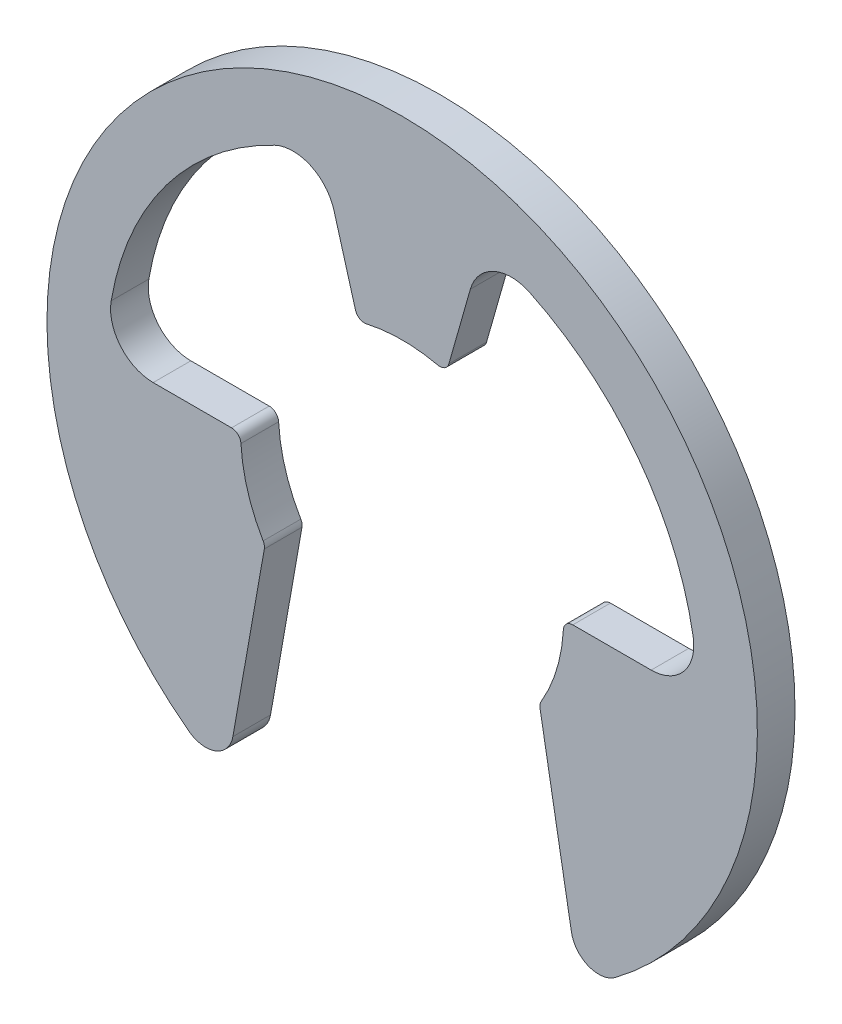
ISO-10303-21;
HEADER;
FILE_DESCRIPTION(('STEP AP214'),'2;1');
FILE_NAME('part.step','',(''),(''),'','','');
FILE_SCHEMA(('AUTOMOTIVE_DESIGN { 1 0 10303 214 1 1 1 1 }'));
ENDSEC;
DATA;
#1=APPLICATION_CONTEXT('core data for automotive mechanical design processes');
#2=APPLICATION_PROTOCOL_DEFINITION('international standard','automotive_design',2000,#1);
#3=PRODUCT_CONTEXT('',#1,'mechanical');
#4=PRODUCT('Part','Part','',(#3));
#5=PRODUCT_RELATED_PRODUCT_CATEGORY('part','',(#4));
#6=PRODUCT_DEFINITION_FORMATION('','',#4);
#7=PRODUCT_DEFINITION_CONTEXT('part definition',#1,'design');
#8=PRODUCT_DEFINITION('design','',#6,#7);
#9=PRODUCT_DEFINITION_SHAPE('','',#8);
#10=(LENGTH_UNIT() NAMED_UNIT(*) SI_UNIT(.MILLI.,.METRE.));
#11=(NAMED_UNIT(*) PLANE_ANGLE_UNIT() SI_UNIT($,.RADIAN.));
#12=(NAMED_UNIT(*) SI_UNIT($,.STERADIAN.) SOLID_ANGLE_UNIT());
#13=UNCERTAINTY_MEASURE_WITH_UNIT(LENGTH_MEASURE(1.E-05),#10,'distance_accuracy_value','');
#14=(GEOMETRIC_REPRESENTATION_CONTEXT(3) GLOBAL_UNCERTAINTY_ASSIGNED_CONTEXT((#13)) GLOBAL_UNIT_ASSIGNED_CONTEXT((#10,
#11,#12)) REPRESENTATION_CONTEXT('',''));
#15=CARTESIAN_POINT('',(0.,0.,0.));
#16=DIRECTION('',(0.,0.,1.));
#17=DIRECTION('',(1.,0.,0.));
#18=AXIS2_PLACEMENT_3D('',#15,#16,#17);
#19=CARTESIAN_POINT('',(-8.382,0.,0.444500000000002));
#20=DIRECTION('',(0.,0.,1.));
#21=DIRECTION('',(1.,0.,0.));
#22=AXIS2_PLACEMENT_3D('',#19,#20,#21);
#23=PLANE('',#22);
#24=CARTESIAN_POINT('',(0.,0.,0.444500000000002));
#25=DIRECTION('',(0.,0.,1.));
#26=DIRECTION('',(-1.,0.,0.));
#27=AXIS2_PLACEMENT_3D('',#24,#25,#26);
#28=CIRCLE('',#27,3.81);
#29=CARTESIAN_POINT('',(3.28050529529567,-1.93762354639312,0.444500000000002));
#30=VERTEX_POINT('',#29);
#31=CARTESIAN_POINT('',(3.80420819619537,-0.21,0.444500000000002));
#32=VERTEX_POINT('',#31);
#33=EDGE_CURVE('E349',#30,#32,#28,.T.);
#34=ORIENTED_EDGE('',*,*,#33,.F.);
#35=CARTESIAN_POINT('',(3.47186810418792,-2.05065158659938,0.4445));
#36=DIRECTION('',(0.,0.,1.));
#37=DIRECTION('',(1.,0.,0.));
#38=AXIS2_PLACEMENT_3D('',#35,#36,#37);
#39=CIRCLE('',#38,0.22225);
#40=CARTESIAN_POINT('',(3.25299458108096,-2.08924489408586,0.444500000000002));
#41=VERTEX_POINT('',#40);
#42=EDGE_CURVE('E293',#30,#41,#39,.T.);
#43=ORIENTED_EDGE('',*,*,#42,.T.);
#44=DIRECTION('',(-0.173648177666931,0.984807753012208,0.));
#45=VECTOR('',#44,1.);
#46=CARTESIAN_POINT('',(3.2385,-2.00704203991845,0.444500000000002));
#47=LINE('',#46,#45);
#48=CARTESIAN_POINT('',(3.99457499603785,-6.29495641921542,0.444500000000002));
#49=VERTEX_POINT('',#48);
#50=EDGE_CURVE('E341',#49,#41,#47,.T.);
#51=ORIENTED_EDGE('',*,*,#50,.F.);
#52=CARTESIAN_POINT('',(4.63843836572622,-6.1814259352495,0.4445));
#53=DIRECTION('',(0.,0.,1.));
#54=DIRECTION('',(1.,0.,0.));
#55=AXIS2_PLACEMENT_3D('',#52,#53,#54);
#56=CIRCLE('',#55,0.653796);
#57=CARTESIAN_POINT('',(5.0308442144536,-6.70436652413177,0.444499999999999));
#58=VERTEX_POINT('',#57);
#59=EDGE_CURVE('E264',#49,#58,#56,.T.);
#60=ORIENTED_EDGE('',*,*,#59,.T.);
#61=CARTESIAN_POINT('',(0.,0.,0.4445));
#62=DIRECTION('',(0.,0.,-1.));
#63=DIRECTION('',(-1.,0.,0.));
#64=AXIS2_PLACEMENT_3D('',#61,#62,#63);
#65=CIRCLE('',#64,8.382);
#66=CARTESIAN_POINT('',(-5.0308442144536,-6.70436652413177,0.444500000000001));
#67=VERTEX_POINT('',#66);
#68=EDGE_CURVE('E228',#67,#58,#65,.T.);
#69=ORIENTED_EDGE('',*,*,#68,.F.);
#70=CARTESIAN_POINT('',(-4.63843836572622,-6.1814259352495,0.444500000000002));
#71=DIRECTION('',(0.,0.,1.));
#72=DIRECTION('',(1.,0.,0.));
#73=AXIS2_PLACEMENT_3D('',#70,#71,#72);
#74=CIRCLE('',#73,0.653796);
#75=CARTESIAN_POINT('',(-3.99457499603785,-6.29495641921542,0.444500000000002));
#76=VERTEX_POINT('',#75);
#77=EDGE_CURVE('E261',#67,#76,#74,.T.);
#78=ORIENTED_EDGE('',*,*,#77,.T.);
#79=DIRECTION('',(-0.173648177666931,-0.984807753012208,0.));
#80=VECTOR('',#79,1.);
#81=CARTESIAN_POINT('',(-3.2385,-2.00704203991845,0.444500000000002));
#82=LINE('',#81,#80);
#83=CARTESIAN_POINT('',(-3.25299458108096,-2.08924489408586,0.444500000000002));
#84=VERTEX_POINT('',#83);
#85=EDGE_CURVE('E338',#84,#76,#82,.T.);
#86=ORIENTED_EDGE('',*,*,#85,.F.);
#87=CARTESIAN_POINT('',(-3.47186810418792,-2.05065158659938,0.444500000000001));
#88=DIRECTION('',(0.,0.,1.));
#89=DIRECTION('',(1.,0.,0.));
#90=AXIS2_PLACEMENT_3D('',#87,#88,#89);
#91=CIRCLE('',#90,0.22225);
#92=CARTESIAN_POINT('',(-3.28050529529567,-1.93762354639312,0.444500000000002));
#93=VERTEX_POINT('',#92);
#94=EDGE_CURVE('E285',#84,#93,#91,.T.);
#95=ORIENTED_EDGE('',*,*,#94,.T.);
#96=CARTESIAN_POINT('',(0.,0.,0.444500000000002));
#97=DIRECTION('',(0.,0.,1.));
#98=DIRECTION('',(1.,0.,0.));
#99=AXIS2_PLACEMENT_3D('',#96,#97,#98);
#100=CIRCLE('',#99,3.81000000000003);
#101=CARTESIAN_POINT('',(-3.80420819619536,-0.21,0.444500000000002));
#102=VERTEX_POINT('',#101);
#103=EDGE_CURVE('E329',#102,#93,#100,.T.);
#104=ORIENTED_EDGE('',*,*,#103,.F.);
#105=CARTESIAN_POINT('',(-4.02612034097343,-0.22225,0.444500000000002));
#106=DIRECTION('',(0.,0.,1.));
#107=DIRECTION('',(1.,0.,0.));
#108=AXIS2_PLACEMENT_3D('',#105,#106,#107);
#109=CIRCLE('',#108,0.22225);
#110=CARTESIAN_POINT('',(-4.02612034097343,0.,0.444500000000002));
#111=VERTEX_POINT('',#110);
#112=EDGE_CURVE('E283',#102,#111,#109,.T.);
#113=ORIENTED_EDGE('',*,*,#112,.T.);
#114=DIRECTION('',(1.,0.,0.));
#115=VECTOR('',#114,1.);
#116=CARTESIAN_POINT('',(-6.96685714285714,0.,0.444500000000002));
#117=LINE('',#116,#115);
#118=CARTESIAN_POINT('',(-5.87554348735815,0.,0.444500000000002));
#119=VERTEX_POINT('',#118);
#120=EDGE_CURVE('E339',#119,#111,#117,.T.);
#121=ORIENTED_EDGE('',*,*,#120,.F.);
#122=CARTESIAN_POINT('',(-5.87554348735815,1.00584,0.444500000000002));
#123=DIRECTION('',(0.,0.,1.));
#124=DIRECTION('',(1.,0.,0.));
#125=AXIS2_PLACEMENT_3D('',#122,#123,#124);
#126=CIRCLE('',#125,1.00584);
#127=CARTESIAN_POINT('',(-6.86696097865086,1.17556172388605,0.444500000000002));
#128=VERTEX_POINT('',#127);
#129=EDGE_CURVE('E254',#119,#128,#126,.F.);
#130=ORIENTED_EDGE('',*,*,#129,.T.);
#131=CARTESIAN_POINT('',(0.,0.,0.444500000000002));
#132=DIRECTION('',(0.,0.,1.));
#133=DIRECTION('',(1.,0.,0.));
#134=AXIS2_PLACEMENT_3D('',#131,#132,#133);
#135=CIRCLE('',#134,6.96685714285714);
#136=CARTESIAN_POINT('',(-3.01121377711484,6.28249075108697,0.444500000000002));
#137=VERTEX_POINT('',#136);
#138=EDGE_CURVE('E343',#137,#128,#135,.T.);
#139=ORIENTED_EDGE('',*,*,#138,.F.);
#140=CARTESIAN_POINT('',(-2.57646978804389,5.37545614889879,0.444500000000001));
#141=DIRECTION('',(0.,0.,1.));
#142=DIRECTION('',(1.,0.,0.));
#143=AXIS2_PLACEMENT_3D('',#140,#141,#142);
#144=CIRCLE('',#143,1.00584);
#145=CARTESIAN_POINT('',(-1.60908385281431,5.65091677751929,0.444500000000002));
#146=VERTEX_POINT('',#145);
#147=EDGE_CURVE('E249',#137,#146,#144,.F.);
#148=ORIENTED_EDGE('',*,*,#147,.T.);
#149=DIRECTION('',(-0.273861278752583,0.961769203083567,0.));
#150=VECTOR('',#149,1.);
#151=CARTESIAN_POINT('',(-1.04341147204734,3.66434066374839,0.444500000000002));
#152=LINE('',#151,#150);
#153=CARTESIAN_POINT('',(-1.10259846499077,3.87219855185656,0.444500000000002));
#154=VERTEX_POINT('',#153);
#155=EDGE_CURVE('E443',#154,#146,#152,.T.);
#156=ORIENTED_EDGE('',*,*,#155,.F.);
#157=CARTESIAN_POINT('',(-0.888845259605446,3.93306422105932,0.444500000000001));
#158=DIRECTION('',(0.,0.,1.));
#159=DIRECTION('',(1.,0.,0.));
#160=AXIS2_PLACEMENT_3D('',#157,#158,#159);
#161=CIRCLE('',#160,0.22225);
#162=CARTESIAN_POINT('',(-0.839853788603571,3.71628115375683,0.444500000000002));
#163=VERTEX_POINT('',#162);
#164=EDGE_CURVE('E287',#154,#163,#161,.T.);
#165=ORIENTED_EDGE('',*,*,#164,.T.);
#166=CARTESIAN_POINT('',(0.,0.,0.444500000000002));
#167=DIRECTION('',(0.,0.,1.));
#168=DIRECTION('',(-1.,0.,0.));
#169=AXIS2_PLACEMENT_3D('',#166,#167,#168);
#170=CIRCLE('',#169,3.81);
#171=CARTESIAN_POINT('',(0.839853788603571,3.71628115375683,0.444500000000002));
#172=VERTEX_POINT('',#171);
#173=EDGE_CURVE('E433',#172,#163,#170,.T.);
#174=ORIENTED_EDGE('',*,*,#173,.F.);
#175=CARTESIAN_POINT('',(0.888845259605446,3.93306422105932,0.444500000000001));
#176=DIRECTION('',(0.,0.,1.));
#177=DIRECTION('',(1.,0.,0.));
#178=AXIS2_PLACEMENT_3D('',#175,#176,#177);
#179=CIRCLE('',#178,0.22225);
#180=CARTESIAN_POINT('',(1.10259846499077,3.87219855185656,0.444500000000002));
#181=VERTEX_POINT('',#180);
#182=EDGE_CURVE('E289',#172,#181,#179,.T.);
#183=ORIENTED_EDGE('',*,*,#182,.T.);
#184=DIRECTION('',(-0.273861278752583,-0.961769203083567,0.));
#185=VECTOR('',#184,1.);
#186=CARTESIAN_POINT('',(1.04341147204734,3.66434066374839,0.444500000000002));
#187=LINE('',#186,#185);
#188=CARTESIAN_POINT('',(1.60908385281431,5.65091677751929,0.444500000000002));
#189=VERTEX_POINT('',#188);
#190=EDGE_CURVE('E356',#189,#181,#187,.T.);
#191=ORIENTED_EDGE('',*,*,#190,.F.);
#192=CARTESIAN_POINT('',(2.57646978804389,5.37545614889879,0.4445));
#193=DIRECTION('',(0.,0.,1.));
#194=DIRECTION('',(1.,0.,0.));
#195=AXIS2_PLACEMENT_3D('',#192,#193,#194);
#196=CIRCLE('',#195,1.00584);
#197=CARTESIAN_POINT('',(3.01121377711484,6.28249075108697,0.444500000000002));
#198=VERTEX_POINT('',#197);
#199=EDGE_CURVE('E209',#189,#198,#196,.F.);
#200=ORIENTED_EDGE('',*,*,#199,.T.);
#201=CARTESIAN_POINT('',(0.,0.,0.444500000000002));
#202=DIRECTION('',(0.,0.,1.));
#203=DIRECTION('',(1.,0.,0.));
#204=AXIS2_PLACEMENT_3D('',#201,#202,#203);
#205=CIRCLE('',#204,6.96685714285714);
#206=CARTESIAN_POINT('',(6.86696097865086,1.17556172388605,0.444500000000002));
#207=VERTEX_POINT('',#206);
#208=EDGE_CURVE('E354',#207,#198,#205,.T.);
#209=ORIENTED_EDGE('',*,*,#208,.F.);
#210=CARTESIAN_POINT('',(5.87554348735815,1.00584,0.4445));
#211=DIRECTION('',(0.,0.,1.));
#212=DIRECTION('',(1.,0.,0.));
#213=AXIS2_PLACEMENT_3D('',#210,#211,#212);
#214=CIRCLE('',#213,1.00584);
#215=CARTESIAN_POINT('',(5.87554348735815,0.,0.444500000000002));
#216=VERTEX_POINT('',#215);
#217=EDGE_CURVE('E210',#207,#216,#214,.F.);
#218=ORIENTED_EDGE('',*,*,#217,.T.);
#219=DIRECTION('',(1.,0.,0.));
#220=VECTOR('',#219,1.);
#221=CARTESIAN_POINT('',(6.96685714285714,0.,0.444500000000002));
#222=LINE('',#221,#220);
#223=CARTESIAN_POINT('',(4.02612034097343,0.,0.444500000000002));
#224=VERTEX_POINT('',#223);
#225=EDGE_CURVE('E352',#224,#216,#222,.T.);
#226=ORIENTED_EDGE('',*,*,#225,.F.);
#227=CARTESIAN_POINT('',(4.02612034097343,-0.22225,0.4445));
#228=DIRECTION('',(0.,0.,1.));
#229=DIRECTION('',(1.,0.,0.));
#230=AXIS2_PLACEMENT_3D('',#227,#228,#229);
#231=CIRCLE('',#230,0.22225);
#232=EDGE_CURVE('E291',#224,#32,#231,.T.);
#233=ORIENTED_EDGE('',*,*,#232,.T.);
#234=EDGE_LOOP('',(#34,#43,#51,#60,#69,#78,#86,#95,#104,#113,#121,#130,#139,#148,#156,#165,#174,
#183,#191,#200,#209,#218,#226,#233));
#235=FACE_BOUND('',#234,.T.);
#236=ADVANCED_FACE('F37',(#235),#23,.T.);
#237=CARTESIAN_POINT('',(0.,0.,-0.444500000000002));
#238=DIRECTION('',(0.,0.,-1.));
#239=DIRECTION('',(-1.,0.,0.));
#240=AXIS2_PLACEMENT_3D('',#237,#238,#239);
#241=CYLINDRICAL_SURFACE('',#240,8.382);
#242=ORIENTED_EDGE('',*,*,#68,.T.);
#243=DIRECTION('',(0.,0.,-1.));
#244=VECTOR('',#243,1.);
#245=CARTESIAN_POINT('',(5.0308442144536,-6.70436652413177,-0.444500000000002));
#246=LINE('',#245,#244);
#247=CARTESIAN_POINT('',(5.0308442144536,-6.70436652413177,-0.444500000000001));
#248=VERTEX_POINT('',#247);
#249=EDGE_CURVE('E269',#58,#248,#246,.T.);
#250=ORIENTED_EDGE('',*,*,#249,.T.);
#251=CARTESIAN_POINT('',(0.,0.,-0.4445));
#252=DIRECTION('',(0.,0.,-1.));
#253=DIRECTION('',(-1.,0.,0.));
#254=AXIS2_PLACEMENT_3D('',#251,#252,#253);
#255=CIRCLE('',#254,8.382);
#256=CARTESIAN_POINT('',(-5.0308442144536,-6.70436652413177,-0.444499999999999));
#257=VERTEX_POINT('',#256);
#258=EDGE_CURVE('E381',#257,#248,#255,.T.);
#259=ORIENTED_EDGE('',*,*,#258,.F.);
#260=DIRECTION('',(0.,0.,-1.));
#261=VECTOR('',#260,1.);
#262=CARTESIAN_POINT('',(-5.0308442144536,-6.70436652413177,-0.444500000000001));
#263=LINE('',#262,#261);
#264=EDGE_CURVE('E266',#257,#67,#263,.F.);
#265=ORIENTED_EDGE('',*,*,#264,.T.);
#266=EDGE_LOOP('',(#242,#250,#259,#265));
#267=FACE_BOUND('',#266,.T.);
#268=ADVANCED_FACE('F387',(#267),#241,.T.);
#269=CARTESIAN_POINT('',(-8.382,0.,-0.444499999999999));
#270=DIRECTION('',(0.,0.,-1.));
#271=DIRECTION('',(-1.,0.,0.));
#272=AXIS2_PLACEMENT_3D('',#269,#270,#271);
#273=PLANE('',#272);
#274=DIRECTION('',(-0.173648177666931,0.984807753012208,0.));
#275=VECTOR('',#274,1.);
#276=CARTESIAN_POINT('',(3.2385,-2.00704203991845,-0.444499999999999));
#277=LINE('',#276,#275);
#278=CARTESIAN_POINT('',(3.99457499603785,-6.29495641921542,-0.444499999999999));
#279=VERTEX_POINT('',#278);
#280=CARTESIAN_POINT('',(3.25299458108096,-2.08924489408586,-0.444499999999999));
#281=VERTEX_POINT('',#280);
#282=EDGE_CURVE('E373',#279,#281,#277,.T.);
#283=ORIENTED_EDGE('',*,*,#282,.T.);
#284=CARTESIAN_POINT('',(3.47186810418792,-2.05065158659938,-0.444500000000001));
#285=DIRECTION('',(0.,0.,-1.));
#286=DIRECTION('',(-1.,0.,0.));
#287=AXIS2_PLACEMENT_3D('',#284,#285,#286);
#288=CIRCLE('',#287,0.22225);
#289=CARTESIAN_POINT('',(3.28050529529567,-1.93762354639312,-0.444499999999999));
#290=VERTEX_POINT('',#289);
#291=EDGE_CURVE('E306',#281,#290,#288,.T.);
#292=ORIENTED_EDGE('',*,*,#291,.T.);
#293=CARTESIAN_POINT('',(0.,0.,-0.444499999999999));
#294=DIRECTION('',(0.,0.,1.));
#295=DIRECTION('',(-1.,0.,0.));
#296=AXIS2_PLACEMENT_3D('',#293,#294,#295);
#297=CIRCLE('',#296,3.81);
#298=CARTESIAN_POINT('',(3.80420819619537,-0.21,-0.444499999999999));
#299=VERTEX_POINT('',#298);
#300=EDGE_CURVE('E375',#290,#299,#297,.T.);
#301=ORIENTED_EDGE('',*,*,#300,.T.);
#302=CARTESIAN_POINT('',(4.02612034097343,-0.22225,-0.444500000000002));
#303=DIRECTION('',(0.,0.,-1.));
#304=DIRECTION('',(-1.,0.,0.));
#305=AXIS2_PLACEMENT_3D('',#302,#303,#304);
#306=CIRCLE('',#305,0.22225);
#307=CARTESIAN_POINT('',(4.02612034097343,0.,-0.444499999999999));
#308=VERTEX_POINT('',#307);
#309=EDGE_CURVE('E304',#299,#308,#306,.T.);
#310=ORIENTED_EDGE('',*,*,#309,.T.);
#311=DIRECTION('',(1.,0.,0.));
#312=VECTOR('',#311,1.);
#313=CARTESIAN_POINT('',(6.96685714285714,0.,-0.444499999999999));
#314=LINE('',#313,#312);
#315=CARTESIAN_POINT('',(5.87554348735815,0.,-0.444499999999999));
#316=VERTEX_POINT('',#315);
#317=EDGE_CURVE('E204',#308,#316,#314,.T.);
#318=ORIENTED_EDGE('',*,*,#317,.T.);
#319=CARTESIAN_POINT('',(5.87554348735815,1.00584,-0.444500000000002));
#320=DIRECTION('',(0.,0.,-1.));
#321=DIRECTION('',(-1.,0.,0.));
#322=AXIS2_PLACEMENT_3D('',#319,#320,#321);
#323=CIRCLE('',#322,1.00584);
#324=CARTESIAN_POINT('',(6.86696097865086,1.17556172388605,-0.444499999999999));
#325=VERTEX_POINT('',#324);
#326=EDGE_CURVE('E197',#316,#325,#323,.F.);
#327=ORIENTED_EDGE('',*,*,#326,.T.);
#328=CARTESIAN_POINT('',(0.,0.,-0.444499999999999));
#329=DIRECTION('',(0.,0.,1.));
#330=DIRECTION('',(1.,0.,0.));
#331=AXIS2_PLACEMENT_3D('',#328,#329,#330);
#332=CIRCLE('',#331,6.96685714285714);
#333=CARTESIAN_POINT('',(3.01121377711484,6.28249075108697,-0.444499999999999));
#334=VERTEX_POINT('',#333);
#335=EDGE_CURVE('E201',#325,#334,#332,.T.);
#336=ORIENTED_EDGE('',*,*,#335,.T.);
#337=CARTESIAN_POINT('',(2.57646978804389,5.37545614889879,-0.444500000000001));
#338=DIRECTION('',(0.,0.,-1.));
#339=DIRECTION('',(-1.,0.,0.));
#340=AXIS2_PLACEMENT_3D('',#337,#338,#339);
#341=CIRCLE('',#340,1.00584);
#342=CARTESIAN_POINT('',(1.60908385281431,5.65091677751929,-0.444499999999999));
#343=VERTEX_POINT('',#342);
#344=EDGE_CURVE('E247',#334,#343,#341,.F.);
#345=ORIENTED_EDGE('',*,*,#344,.T.);
#346=DIRECTION('',(-0.273861278752583,-0.961769203083567,0.));
#347=VECTOR('',#346,1.);
#348=CARTESIAN_POINT('',(1.04341147204734,3.66434066374839,-0.444499999999999));
#349=LINE('',#348,#347);
#350=CARTESIAN_POINT('',(1.10259846499077,3.87219855185656,-0.444499999999999));
#351=VERTEX_POINT('',#350);
#352=EDGE_CURVE('E220',#343,#351,#349,.T.);
#353=ORIENTED_EDGE('',*,*,#352,.T.);
#354=CARTESIAN_POINT('',(0.888845259605446,3.93306422105932,-0.444500000000001));
#355=DIRECTION('',(0.,0.,-1.));
#356=DIRECTION('',(-1.,0.,0.));
#357=AXIS2_PLACEMENT_3D('',#354,#355,#356);
#358=CIRCLE('',#357,0.22225);
#359=CARTESIAN_POINT('',(0.839853788603571,3.71628115375683,-0.444499999999999));
#360=VERTEX_POINT('',#359);
#361=EDGE_CURVE('E302',#351,#360,#358,.T.);
#362=ORIENTED_EDGE('',*,*,#361,.T.);
#363=CARTESIAN_POINT('',(0.,0.,-0.444499999999999));
#364=DIRECTION('',(0.,0.,1.));
#365=DIRECTION('',(-1.,0.,0.));
#366=AXIS2_PLACEMENT_3D('',#363,#364,#365);
#367=CIRCLE('',#366,3.81);
#368=CARTESIAN_POINT('',(-0.839853788603571,3.71628115375683,-0.444499999999999));
#369=VERTEX_POINT('',#368);
#370=EDGE_CURVE('E359',#360,#369,#367,.T.);
#371=ORIENTED_EDGE('',*,*,#370,.T.);
#372=CARTESIAN_POINT('',(-0.888845259605446,3.93306422105932,-0.444500000000001));
#373=DIRECTION('',(0.,0.,-1.));
#374=DIRECTION('',(-1.,0.,0.));
#375=AXIS2_PLACEMENT_3D('',#372,#373,#374);
#376=CIRCLE('',#375,0.22225);
#377=CARTESIAN_POINT('',(-1.10259846499077,3.87219855185656,-0.444499999999999));
#378=VERTEX_POINT('',#377);
#379=EDGE_CURVE('E300',#369,#378,#376,.T.);
#380=ORIENTED_EDGE('',*,*,#379,.T.);
#381=DIRECTION('',(-0.273861278752583,0.961769203083567,0.));
#382=VECTOR('',#381,1.);
#383=CARTESIAN_POINT('',(-1.04341147204734,3.66434066374839,-0.444499999999999));
#384=LINE('',#383,#382);
#385=CARTESIAN_POINT('',(-1.60908385281431,5.65091677751929,-0.444499999999999));
#386=VERTEX_POINT('',#385);
#387=EDGE_CURVE('E362',#378,#386,#384,.T.);
#388=ORIENTED_EDGE('',*,*,#387,.T.);
#389=CARTESIAN_POINT('',(-2.57646978804389,5.37545614889879,-0.4445));
#390=DIRECTION('',(0.,0.,-1.));
#391=DIRECTION('',(-1.,0.,0.));
#392=AXIS2_PLACEMENT_3D('',#389,#390,#391);
#393=CIRCLE('',#392,1.00584);
#394=CARTESIAN_POINT('',(-3.01121377711484,6.28249075108697,-0.444499999999999));
#395=VERTEX_POINT('',#394);
#396=EDGE_CURVE('E252',#386,#395,#393,.F.);
#397=ORIENTED_EDGE('',*,*,#396,.T.);
#398=CARTESIAN_POINT('',(0.,0.,-0.444499999999999));
#399=DIRECTION('',(0.,0.,1.));
#400=DIRECTION('',(1.,0.,0.));
#401=AXIS2_PLACEMENT_3D('',#398,#399,#400);
#402=CIRCLE('',#401,6.96685714285714);
#403=CARTESIAN_POINT('',(-6.86696097865086,1.17556172388605,-0.444499999999999));
#404=VERTEX_POINT('',#403);
#405=EDGE_CURVE('E364',#395,#404,#402,.T.);
#406=ORIENTED_EDGE('',*,*,#405,.T.);
#407=CARTESIAN_POINT('',(-5.87554348735815,1.00584,-0.4445));
#408=DIRECTION('',(0.,0.,-1.));
#409=DIRECTION('',(-1.,0.,0.));
#410=AXIS2_PLACEMENT_3D('',#407,#408,#409);
#411=CIRCLE('',#410,1.00584);
#412=CARTESIAN_POINT('',(-5.87554348735815,0.,-0.444499999999999));
#413=VERTEX_POINT('',#412);
#414=EDGE_CURVE('E256',#404,#413,#411,.F.);
#415=ORIENTED_EDGE('',*,*,#414,.T.);
#416=DIRECTION('',(1.,0.,0.));
#417=VECTOR('',#416,1.);
#418=CARTESIAN_POINT('',(-6.96685714285714,0.,-0.444499999999999));
#419=LINE('',#418,#417);
#420=CARTESIAN_POINT('',(-4.02612034097343,0.,-0.444499999999999));
#421=VERTEX_POINT('',#420);
#422=EDGE_CURVE('E367',#413,#421,#419,.T.);
#423=ORIENTED_EDGE('',*,*,#422,.T.);
#424=CARTESIAN_POINT('',(-4.02612034097343,-0.22225,-0.4445));
#425=DIRECTION('',(0.,0.,-1.));
#426=DIRECTION('',(-1.,0.,0.));
#427=AXIS2_PLACEMENT_3D('',#424,#425,#426);
#428=CIRCLE('',#427,0.22225);
#429=CARTESIAN_POINT('',(-3.80420819619536,-0.21,-0.444499999999999));
#430=VERTEX_POINT('',#429);
#431=EDGE_CURVE('E297',#421,#430,#428,.T.);
#432=ORIENTED_EDGE('',*,*,#431,.T.);
#433=CARTESIAN_POINT('',(0.,0.,-0.444499999999999));
#434=DIRECTION('',(0.,0.,1.));
#435=DIRECTION('',(1.,0.,0.));
#436=AXIS2_PLACEMENT_3D('',#433,#434,#435);
#437=CIRCLE('',#436,3.81000000000003);
#438=CARTESIAN_POINT('',(-3.28050529529567,-1.93762354639312,-0.444499999999999));
#439=VERTEX_POINT('',#438);
#440=EDGE_CURVE('E330',#430,#439,#437,.T.);
#441=ORIENTED_EDGE('',*,*,#440,.T.);
#442=CARTESIAN_POINT('',(-3.47186810418792,-2.05065158659938,-0.4445));
#443=DIRECTION('',(0.,0.,-1.));
#444=DIRECTION('',(-1.,0.,0.));
#445=AXIS2_PLACEMENT_3D('',#442,#443,#444);
#446=CIRCLE('',#445,0.22225);
#447=CARTESIAN_POINT('',(-3.25299458108096,-2.08924489408586,-0.444499999999999));
#448=VERTEX_POINT('',#447);
#449=EDGE_CURVE('E52',#439,#448,#446,.T.);
#450=ORIENTED_EDGE('',*,*,#449,.T.);
#451=DIRECTION('',(-0.173648177666931,-0.984807753012208,0.));
#452=VECTOR('',#451,1.);
#453=CARTESIAN_POINT('',(-3.2385,-2.00704203991845,-0.444499999999999));
#454=LINE('',#453,#452);
#455=CARTESIAN_POINT('',(-3.99457499603785,-6.29495641921542,-0.444499999999999));
#456=VERTEX_POINT('',#455);
#457=EDGE_CURVE('E371',#448,#456,#454,.T.);
#458=ORIENTED_EDGE('',*,*,#457,.T.);
#459=CARTESIAN_POINT('',(-4.63843836572622,-6.1814259352495,-0.4445));
#460=DIRECTION('',(0.,0.,-1.));
#461=DIRECTION('',(-1.,0.,0.));
#462=AXIS2_PLACEMENT_3D('',#459,#460,#461);
#463=CIRCLE('',#462,0.653796);
#464=EDGE_CURVE('E271',#456,#257,#463,.T.);
#465=ORIENTED_EDGE('',*,*,#464,.T.);
#466=ORIENTED_EDGE('',*,*,#258,.T.);
#467=CARTESIAN_POINT('',(4.63843836572622,-6.1814259352495,-0.444500000000002));
#468=DIRECTION('',(0.,0.,-1.));
#469=DIRECTION('',(-1.,0.,0.));
#470=AXIS2_PLACEMENT_3D('',#467,#468,#469);
#471=CIRCLE('',#470,0.653796);
#472=EDGE_CURVE('E273',#248,#279,#471,.T.);
#473=ORIENTED_EDGE('',*,*,#472,.T.);
#474=EDGE_LOOP('',(#283,#292,#301,#310,#318,#327,#336,#345,#353,#362,#371,#380,#388,#397,#406,
#415,#423,#432,#441,#450,#458,#465,#466,#473));
#475=FACE_BOUND('',#474,.T.);
#476=ADVANCED_FACE('F200',(#475),#273,.T.);
#477=CARTESIAN_POINT('',(0.,0.,-0.444499999999999));
#478=DIRECTION('',(0.,0.,1.));
#479=DIRECTION('',(1.,0.,0.));
#480=AXIS2_PLACEMENT_3D('',#477,#478,#479);
#481=CYLINDRICAL_SURFACE('',#480,3.81);
#482=ORIENTED_EDGE('',*,*,#370,.F.);
#483=DIRECTION('',(0.,0.,1.));
#484=VECTOR('',#483,1.);
#485=CARTESIAN_POINT('',(0.839853788603571,3.71628115375683,-0.444499999999999));
#486=LINE('',#485,#484);
#487=EDGE_CURVE('E313',#360,#172,#486,.T.);
#488=ORIENTED_EDGE('',*,*,#487,.T.);
#489=ORIENTED_EDGE('',*,*,#173,.T.);
#490=DIRECTION('',(0.,0.,1.));
#491=VECTOR('',#490,1.);
#492=CARTESIAN_POINT('',(-0.839853788603571,3.71628115375683,-0.444499999999999));
#493=LINE('',#492,#491);
#494=EDGE_CURVE('E311',#163,#369,#493,.F.);
#495=ORIENTED_EDGE('',*,*,#494,.T.);
#496=EDGE_LOOP('',(#482,#488,#489,#495));
#497=FACE_BOUND('',#496,.T.);
#498=ADVANCED_FACE('F429',(#497),#481,.F.);
#499=CARTESIAN_POINT('',(1.04341147204734,3.66434066374839,-0.444499999999999));
#500=DIRECTION('',(-0.961769203083567,0.273861278752583,0.));
#501=DIRECTION('',(-0.273861278752583,-0.961769203083567,0.));
#502=AXIS2_PLACEMENT_3D('',#499,#500,#501);
#503=PLANE('',#502);
#504=ORIENTED_EDGE('',*,*,#190,.T.);
#505=DIRECTION('',(0.,0.,1.));
#506=VECTOR('',#505,1.);
#507=CARTESIAN_POINT('',(1.10259846499077,3.87219855185656,-0.444499999999999));
#508=LINE('',#507,#506);
#509=EDGE_CURVE('E316',#181,#351,#508,.F.);
#510=ORIENTED_EDGE('',*,*,#509,.T.);
#511=ORIENTED_EDGE('',*,*,#352,.F.);
#512=DIRECTION('',(0.,0.,-1.));
#513=VECTOR('',#512,1.);
#514=CARTESIAN_POINT('',(1.60908385281431,5.65091677751929,0.444500000000002));
#515=LINE('',#514,#513);
#516=EDGE_CURVE('E226',#343,#189,#515,.F.);
#517=ORIENTED_EDGE('',*,*,#516,.T.);
#518=EDGE_LOOP('',(#504,#510,#511,#517));
#519=FACE_BOUND('',#518,.T.);
#520=ADVANCED_FACE('F421',(#519),#503,.F.);
#521=CARTESIAN_POINT('',(0.,0.,-0.444499999999999));
#522=DIRECTION('',(0.,0.,1.));
#523=DIRECTION('',(1.,0.,0.));
#524=AXIS2_PLACEMENT_3D('',#521,#522,#523);
#525=CYLINDRICAL_SURFACE('',#524,6.96685714285714);
#526=ORIENTED_EDGE('',*,*,#335,.F.);
#527=DIRECTION('',(0.,0.,1.));
#528=VECTOR('',#527,1.);
#529=CARTESIAN_POINT('',(6.86696097865087,1.17556172388605,-0.444499999999999));
#530=LINE('',#529,#528);
#531=EDGE_CURVE('E216',#325,#207,#530,.T.);
#532=ORIENTED_EDGE('',*,*,#531,.T.);
#533=ORIENTED_EDGE('',*,*,#208,.T.);
#534=DIRECTION('',(0.,0.,1.));
#535=VECTOR('',#534,1.);
#536=CARTESIAN_POINT('',(3.01121377711484,6.28249075108697,-0.444499999999999));
#537=LINE('',#536,#535);
#538=EDGE_CURVE('E219',#198,#334,#537,.F.);
#539=ORIENTED_EDGE('',*,*,#538,.T.);
#540=EDGE_LOOP('',(#526,#532,#533,#539));
#541=FACE_BOUND('',#540,.T.);
#542=ADVANCED_FACE('F214',(#541),#525,.F.);
#543=CARTESIAN_POINT('',(6.96685714285714,0.,-0.444499999999999));
#544=DIRECTION('',(0.,-1.,0.));
#545=DIRECTION('',(1.,0.,0.));
#546=AXIS2_PLACEMENT_3D('',#543,#544,#545);
#547=PLANE('',#546);
#548=ORIENTED_EDGE('',*,*,#317,.F.);
#549=DIRECTION('',(0.,0.,1.));
#550=VECTOR('',#549,1.);
#551=CARTESIAN_POINT('',(4.02612034097343,0.,-0.444499999999999));
#552=LINE('',#551,#550);
#553=EDGE_CURVE('E308',#308,#224,#552,.T.);
#554=ORIENTED_EDGE('',*,*,#553,.T.);
#555=ORIENTED_EDGE('',*,*,#225,.T.);
#556=DIRECTION('',(0.,0.,-1.));
#557=VECTOR('',#556,1.);
#558=CARTESIAN_POINT('',(5.87554348735815,0.,-0.444499999999999));
#559=LINE('',#558,#557);
#560=EDGE_CURVE('E224',#216,#316,#559,.T.);
#561=ORIENTED_EDGE('',*,*,#560,.T.);
#562=EDGE_LOOP('',(#548,#554,#555,#561));
#563=FACE_BOUND('',#562,.T.);
#564=ADVANCED_FACE('F412',(#563),#547,.F.);
#565=CARTESIAN_POINT('',(0.,0.,-0.444499999999999));
#566=DIRECTION('',(0.,0.,1.));
#567=DIRECTION('',(1.,0.,0.));
#568=AXIS2_PLACEMENT_3D('',#565,#566,#567);
#569=CYLINDRICAL_SURFACE('',#568,3.81);
#570=ORIENTED_EDGE('',*,*,#300,.F.);
#571=DIRECTION('',(0.,0.,1.));
#572=VECTOR('',#571,1.);
#573=CARTESIAN_POINT('',(3.28050529529568,-1.93762354639312,-0.444499999999999));
#574=LINE('',#573,#572);
#575=EDGE_CURVE('E280',#290,#30,#574,.T.);
#576=ORIENTED_EDGE('',*,*,#575,.T.);
#577=ORIENTED_EDGE('',*,*,#33,.T.);
#578=DIRECTION('',(0.,0.,1.));
#579=VECTOR('',#578,1.);
#580=CARTESIAN_POINT('',(3.80420819619537,-0.21,-0.444499999999999));
#581=LINE('',#580,#579);
#582=EDGE_CURVE('E278',#32,#299,#581,.F.);
#583=ORIENTED_EDGE('',*,*,#582,.T.);
#584=EDGE_LOOP('',(#570,#576,#577,#583));
#585=FACE_BOUND('',#584,.T.);
#586=ADVANCED_FACE('F406',(#585),#569,.F.);
#587=CARTESIAN_POINT('',(3.2385,-2.00704203991845,-0.444499999999999));
#588=DIRECTION('',(0.984807753012208,0.173648177666931,0.));
#589=DIRECTION('',(-0.173648177666931,0.984807753012208,0.));
#590=AXIS2_PLACEMENT_3D('',#587,#588,#589);
#591=PLANE('',#590);
#592=ORIENTED_EDGE('',*,*,#50,.T.);
#593=DIRECTION('',(0.,0.,1.));
#594=VECTOR('',#593,1.);
#595=CARTESIAN_POINT('',(3.25299458108096,-2.08924489408586,-0.444499999999999));
#596=LINE('',#595,#594);
#597=EDGE_CURVE('E295',#41,#281,#596,.F.);
#598=ORIENTED_EDGE('',*,*,#597,.T.);
#599=ORIENTED_EDGE('',*,*,#282,.F.);
#600=DIRECTION('',(0.,0.,1.));
#601=VECTOR('',#600,1.);
#602=CARTESIAN_POINT('',(3.99457499603785,-6.29495641921542,0.444500000000001));
#603=LINE('',#602,#601);
#604=EDGE_CURVE('E258',#279,#49,#603,.T.);
#605=ORIENTED_EDGE('',*,*,#604,.T.);
#606=EDGE_LOOP('',(#592,#598,#599,#605));
#607=FACE_BOUND('',#606,.T.);
#608=ADVANCED_FACE('F397',(#607),#591,.F.);
#609=CARTESIAN_POINT('',(-3.2385,-2.00704203991845,-0.444499999999999));
#610=DIRECTION('',(-0.984807753012208,0.173648177666931,0.));
#611=DIRECTION('',(-0.173648177666931,-0.984807753012208,0.));
#612=AXIS2_PLACEMENT_3D('',#609,#610,#611);
#613=PLANE('',#612);
#614=ORIENTED_EDGE('',*,*,#457,.F.);
#615=DIRECTION('',(0.,0.,1.));
#616=VECTOR('',#615,1.);
#617=CARTESIAN_POINT('',(-3.25299458108096,-2.08924489408586,-0.444499999999999));
#618=LINE('',#617,#616);
#619=EDGE_CURVE('E321',#448,#84,#618,.T.);
#620=ORIENTED_EDGE('',*,*,#619,.T.);
#621=ORIENTED_EDGE('',*,*,#85,.T.);
#622=DIRECTION('',(0.,0.,1.));
#623=VECTOR('',#622,1.);
#624=CARTESIAN_POINT('',(-3.99457499603785,-6.29495641921542,-0.444499999999998));
#625=LINE('',#624,#623);
#626=EDGE_CURVE('E275',#76,#456,#625,.F.);
#627=ORIENTED_EDGE('',*,*,#626,.T.);
#628=EDGE_LOOP('',(#614,#620,#621,#627));
#629=FACE_BOUND('',#628,.T.);
#630=ADVANCED_FACE('F465',(#629),#613,.F.);
#631=CARTESIAN_POINT('',(0.,0.,-0.444499999999999));
#632=DIRECTION('',(0.,0.,1.));
#633=DIRECTION('',(1.,0.,0.));
#634=AXIS2_PLACEMENT_3D('',#631,#632,#633);
#635=CYLINDRICAL_SURFACE('',#634,3.81000000000003);
#636=ORIENTED_EDGE('',*,*,#103,.T.);
#637=DIRECTION('',(0.,0.,1.));
#638=VECTOR('',#637,1.);
#639=CARTESIAN_POINT('',(-3.28050529529567,-1.93762354639312,-0.444499999999999));
#640=LINE('',#639,#638);
#641=EDGE_CURVE('E45',#93,#439,#640,.F.);
#642=ORIENTED_EDGE('',*,*,#641,.T.);
#643=ORIENTED_EDGE('',*,*,#440,.F.);
#644=DIRECTION('',(0.,0.,1.));
#645=VECTOR('',#644,1.);
#646=CARTESIAN_POINT('',(-3.80420819619537,-0.21,-0.444499999999999));
#647=LINE('',#646,#645);
#648=EDGE_CURVE('E324',#430,#102,#647,.T.);
#649=ORIENTED_EDGE('',*,*,#648,.T.);
#650=EDGE_LOOP('',(#636,#642,#643,#649));
#651=FACE_BOUND('',#650,.T.);
#652=ADVANCED_FACE('F328',(#651),#635,.F.);
#653=CARTESIAN_POINT('',(-6.96685714285714,0.,-0.444499999999999));
#654=DIRECTION('',(0.,-1.,0.));
#655=DIRECTION('',(1.,0.,0.));
#656=AXIS2_PLACEMENT_3D('',#653,#654,#655);
#657=PLANE('',#656);
#658=ORIENTED_EDGE('',*,*,#120,.T.);
#659=DIRECTION('',(0.,0.,1.));
#660=VECTOR('',#659,1.);
#661=CARTESIAN_POINT('',(-4.02612034097343,0.,-0.444499999999999));
#662=LINE('',#661,#660);
#663=EDGE_CURVE('E11',#111,#421,#662,.F.);
#664=ORIENTED_EDGE('',*,*,#663,.T.);
#665=ORIENTED_EDGE('',*,*,#422,.F.);
#666=DIRECTION('',(0.,0.,-1.));
#667=VECTOR('',#666,1.);
#668=CARTESIAN_POINT('',(-5.87554348735815,0.,0.444500000000002));
#669=LINE('',#668,#667);
#670=EDGE_CURVE('E242',#413,#119,#669,.F.);
#671=ORIENTED_EDGE('',*,*,#670,.T.);
#672=EDGE_LOOP('',(#658,#664,#665,#671));
#673=FACE_BOUND('',#672,.T.);
#674=ADVANCED_FACE('F459',(#673),#657,.F.);
#675=CARTESIAN_POINT('',(0.,0.,-0.444499999999999));
#676=DIRECTION('',(0.,0.,1.));
#677=DIRECTION('',(1.,0.,0.));
#678=AXIS2_PLACEMENT_3D('',#675,#676,#677);
#679=CYLINDRICAL_SURFACE('',#678,6.96685714285714);
#680=ORIENTED_EDGE('',*,*,#405,.F.);
#681=DIRECTION('',(0.,0.,1.));
#682=VECTOR('',#681,1.);
#683=CARTESIAN_POINT('',(-3.01121377711484,6.28249075108697,-0.444499999999999));
#684=LINE('',#683,#682);
#685=EDGE_CURVE('E236',#395,#137,#684,.T.);
#686=ORIENTED_EDGE('',*,*,#685,.T.);
#687=ORIENTED_EDGE('',*,*,#138,.T.);
#688=DIRECTION('',(0.,0.,1.));
#689=VECTOR('',#688,1.);
#690=CARTESIAN_POINT('',(-6.86696097865087,1.17556172388605,-0.444499999999999));
#691=LINE('',#690,#689);
#692=EDGE_CURVE('E234',#128,#404,#691,.F.);
#693=ORIENTED_EDGE('',*,*,#692,.T.);
#694=EDGE_LOOP('',(#680,#686,#687,#693));
#695=FACE_BOUND('',#694,.T.);
#696=ADVANCED_FACE('F450',(#695),#679,.F.);
#697=CARTESIAN_POINT('',(-1.04341147204734,3.66434066374839,-0.444499999999999));
#698=DIRECTION('',(0.961769203083567,0.273861278752583,0.));
#699=DIRECTION('',(-0.273861278752583,0.961769203083567,0.));
#700=AXIS2_PLACEMENT_3D('',#697,#698,#699);
#701=PLANE('',#700);
#702=ORIENTED_EDGE('',*,*,#387,.F.);
#703=DIRECTION('',(0.,0.,1.));
#704=VECTOR('',#703,1.);
#705=CARTESIAN_POINT('',(-1.10259846499077,3.87219855185656,-0.444499999999999));
#706=LINE('',#705,#704);
#707=EDGE_CURVE('E318',#378,#154,#706,.T.);
#708=ORIENTED_EDGE('',*,*,#707,.T.);
#709=ORIENTED_EDGE('',*,*,#155,.T.);
#710=DIRECTION('',(0.,0.,-1.));
#711=VECTOR('',#710,1.);
#712=CARTESIAN_POINT('',(-1.60908385281431,5.65091677751929,-0.4445));
#713=LINE('',#712,#711);
#714=EDGE_CURVE('E239',#146,#386,#713,.T.);
#715=ORIENTED_EDGE('',*,*,#714,.T.);
#716=EDGE_LOOP('',(#702,#708,#709,#715));
#717=FACE_BOUND('',#716,.T.);
#718=ADVANCED_FACE('F439',(#717),#701,.F.);
#719=CARTESIAN_POINT('',(5.87554348735815,1.00584,-0.444499999999999));
#720=DIRECTION('',(0.,0.,1.));
#721=DIRECTION('',(1.,0.,0.));
#722=AXIS2_PLACEMENT_3D('',#719,#720,#721);
#723=CYLINDRICAL_SURFACE('',#722,1.00584);
#724=ORIENTED_EDGE('',*,*,#326,.F.);
#725=ORIENTED_EDGE('',*,*,#560,.F.);
#726=ORIENTED_EDGE('',*,*,#217,.F.);
#727=ORIENTED_EDGE('',*,*,#531,.F.);
#728=EDGE_LOOP('',(#724,#725,#726,#727));
#729=FACE_BOUND('',#728,.T.);
#730=ADVANCED_FACE('F222',(#729),#723,.F.);
#731=CARTESIAN_POINT('',(2.57646978804389,5.37545614889879,-0.444499999999999));
#732=DIRECTION('',(0.,0.,1.));
#733=DIRECTION('',(1.,0.,0.));
#734=AXIS2_PLACEMENT_3D('',#731,#732,#733);
#735=CYLINDRICAL_SURFACE('',#734,1.00584);
#736=ORIENTED_EDGE('',*,*,#344,.F.);
#737=ORIENTED_EDGE('',*,*,#538,.F.);
#738=ORIENTED_EDGE('',*,*,#199,.F.);
#739=ORIENTED_EDGE('',*,*,#516,.F.);
#740=EDGE_LOOP('',(#736,#737,#738,#739));
#741=FACE_BOUND('',#740,.T.);
#742=ADVANCED_FACE('F416',(#741),#735,.F.);
#743=CARTESIAN_POINT('',(-2.57646978804389,5.37545614889879,-0.444499999999999));
#744=DIRECTION('',(0.,0.,1.));
#745=DIRECTION('',(1.,0.,0.));
#746=AXIS2_PLACEMENT_3D('',#743,#744,#745);
#747=CYLINDRICAL_SURFACE('',#746,1.00584);
#748=ORIENTED_EDGE('',*,*,#396,.F.);
#749=ORIENTED_EDGE('',*,*,#714,.F.);
#750=ORIENTED_EDGE('',*,*,#147,.F.);
#751=ORIENTED_EDGE('',*,*,#685,.F.);
#752=EDGE_LOOP('',(#748,#749,#750,#751));
#753=FACE_BOUND('',#752,.T.);
#754=ADVANCED_FACE('F446',(#753),#747,.F.);
#755=CARTESIAN_POINT('',(-5.87554348735815,1.00584,-0.444499999999999));
#756=DIRECTION('',(0.,0.,1.));
#757=DIRECTION('',(1.,0.,0.));
#758=AXIS2_PLACEMENT_3D('',#755,#756,#757);
#759=CYLINDRICAL_SURFACE('',#758,1.00584);
#760=ORIENTED_EDGE('',*,*,#414,.F.);
#761=ORIENTED_EDGE('',*,*,#692,.F.);
#762=ORIENTED_EDGE('',*,*,#129,.F.);
#763=ORIENTED_EDGE('',*,*,#670,.F.);
#764=EDGE_LOOP('',(#760,#761,#762,#763));
#765=FACE_BOUND('',#764,.T.);
#766=ADVANCED_FACE('F455',(#765),#759,.F.);
#767=CARTESIAN_POINT('',(4.63843836572622,-6.1814259352495,-0.444500000000002));
#768=DIRECTION('',(0.,0.,-1.));
#769=DIRECTION('',(-1.,0.,0.));
#770=AXIS2_PLACEMENT_3D('',#767,#768,#769);
#771=CYLINDRICAL_SURFACE('',#770,0.653796);
#772=ORIENTED_EDGE('',*,*,#472,.F.);
#773=ORIENTED_EDGE('',*,*,#249,.F.);
#774=ORIENTED_EDGE('',*,*,#59,.F.);
#775=ORIENTED_EDGE('',*,*,#604,.F.);
#776=EDGE_LOOP('',(#772,#773,#774,#775));
#777=FACE_BOUND('',#776,.T.);
#778=ADVANCED_FACE('F392',(#777),#771,.T.);
#779=CARTESIAN_POINT('',(-4.63843836572622,-6.1814259352495,-0.444500000000001));
#780=DIRECTION('',(0.,0.,-1.));
#781=DIRECTION('',(-1.,0.,0.));
#782=AXIS2_PLACEMENT_3D('',#779,#780,#781);
#783=CYLINDRICAL_SURFACE('',#782,0.653796);
#784=ORIENTED_EDGE('',*,*,#464,.F.);
#785=ORIENTED_EDGE('',*,*,#626,.F.);
#786=ORIENTED_EDGE('',*,*,#77,.F.);
#787=ORIENTED_EDGE('',*,*,#264,.F.);
#788=EDGE_LOOP('',(#784,#785,#786,#787));
#789=FACE_BOUND('',#788,.T.);
#790=ADVANCED_FACE('F469',(#789),#783,.T.);
#791=CARTESIAN_POINT('',(3.47186810418792,-2.05065158659938,-0.444499999999999));
#792=DIRECTION('',(0.,0.,1.));
#793=DIRECTION('',(1.,0.,0.));
#794=AXIS2_PLACEMENT_3D('',#791,#792,#793);
#795=CYLINDRICAL_SURFACE('',#794,0.22225);
#796=ORIENTED_EDGE('',*,*,#291,.F.);
#797=ORIENTED_EDGE('',*,*,#597,.F.);
#798=ORIENTED_EDGE('',*,*,#42,.F.);
#799=ORIENTED_EDGE('',*,*,#575,.F.);
#800=EDGE_LOOP('',(#796,#797,#798,#799));
#801=FACE_BOUND('',#800,.T.);
#802=ADVANCED_FACE('F401',(#801),#795,.T.);
#803=CARTESIAN_POINT('',(4.02612034097343,-0.22225,-0.444499999999999));
#804=DIRECTION('',(0.,0.,1.));
#805=DIRECTION('',(1.,0.,0.));
#806=AXIS2_PLACEMENT_3D('',#803,#804,#805);
#807=CYLINDRICAL_SURFACE('',#806,0.22225);
#808=ORIENTED_EDGE('',*,*,#309,.F.);
#809=ORIENTED_EDGE('',*,*,#582,.F.);
#810=ORIENTED_EDGE('',*,*,#232,.F.);
#811=ORIENTED_EDGE('',*,*,#553,.F.);
#812=EDGE_LOOP('',(#808,#809,#810,#811));
#813=FACE_BOUND('',#812,.T.);
#814=ADVANCED_FACE('F409',(#813),#807,.T.);
#815=CARTESIAN_POINT('',(0.888845259605446,3.93306422105932,-0.444499999999999));
#816=DIRECTION('',(0.,0.,1.));
#817=DIRECTION('',(1.,0.,0.));
#818=AXIS2_PLACEMENT_3D('',#815,#816,#817);
#819=CYLINDRICAL_SURFACE('',#818,0.22225);
#820=ORIENTED_EDGE('',*,*,#361,.F.);
#821=ORIENTED_EDGE('',*,*,#509,.F.);
#822=ORIENTED_EDGE('',*,*,#182,.F.);
#823=ORIENTED_EDGE('',*,*,#487,.F.);
#824=EDGE_LOOP('',(#820,#821,#822,#823));
#825=FACE_BOUND('',#824,.T.);
#826=ADVANCED_FACE('F424',(#825),#819,.T.);
#827=CARTESIAN_POINT('',(-0.888845259605446,3.93306422105932,-0.444499999999999));
#828=DIRECTION('',(0.,0.,1.));
#829=DIRECTION('',(1.,0.,0.));
#830=AXIS2_PLACEMENT_3D('',#827,#828,#829);
#831=CYLINDRICAL_SURFACE('',#830,0.22225);
#832=ORIENTED_EDGE('',*,*,#379,.F.);
#833=ORIENTED_EDGE('',*,*,#494,.F.);
#834=ORIENTED_EDGE('',*,*,#164,.F.);
#835=ORIENTED_EDGE('',*,*,#707,.F.);
#836=EDGE_LOOP('',(#832,#833,#834,#835));
#837=FACE_BOUND('',#836,.T.);
#838=ADVANCED_FACE('F435',(#837),#831,.T.);
#839=CARTESIAN_POINT('',(-3.47186810418792,-2.05065158659938,-0.444499999999999));
#840=DIRECTION('',(0.,0.,1.));
#841=DIRECTION('',(1.,0.,0.));
#842=AXIS2_PLACEMENT_3D('',#839,#840,#841);
#843=CYLINDRICAL_SURFACE('',#842,0.22225);
#844=ORIENTED_EDGE('',*,*,#449,.F.);
#845=ORIENTED_EDGE('',*,*,#641,.F.);
#846=ORIENTED_EDGE('',*,*,#94,.F.);
#847=ORIENTED_EDGE('',*,*,#619,.F.);
#848=EDGE_LOOP('',(#844,#845,#846,#847));
#849=FACE_BOUND('',#848,.T.);
#850=ADVANCED_FACE('F463',(#849),#843,.T.);
#851=CARTESIAN_POINT('',(-4.02612034097343,-0.22225,-0.444499999999999));
#852=DIRECTION('',(0.,0.,1.));
#853=DIRECTION('',(1.,0.,0.));
#854=AXIS2_PLACEMENT_3D('',#851,#852,#853);
#855=CYLINDRICAL_SURFACE('',#854,0.22225);
#856=ORIENTED_EDGE('',*,*,#431,.F.);
#857=ORIENTED_EDGE('',*,*,#663,.F.);
#858=ORIENTED_EDGE('',*,*,#112,.F.);
#859=ORIENTED_EDGE('',*,*,#648,.F.);
#860=EDGE_LOOP('',(#856,#857,#858,#859));
#861=FACE_BOUND('',#860,.T.);
#862=ADVANCED_FACE('F39',(#861),#855,.T.);
#863=CLOSED_SHELL('',(#236,#268,#476,#498,#520,#542,#564,#586,#608,#630,#652,#674,#696,#718,
#730,#742,#754,#766,#778,#790,#802,#814,#826,#838,#850,#862));
#864=MANIFOLD_SOLID_BREP('B2',#863);
#865=ADVANCED_BREP_SHAPE_REPRESENTATION('',(#18,#864),#14);
#866=SHAPE_DEFINITION_REPRESENTATION(#9,#865);
ENDSEC;
END-ISO-10303-21;
